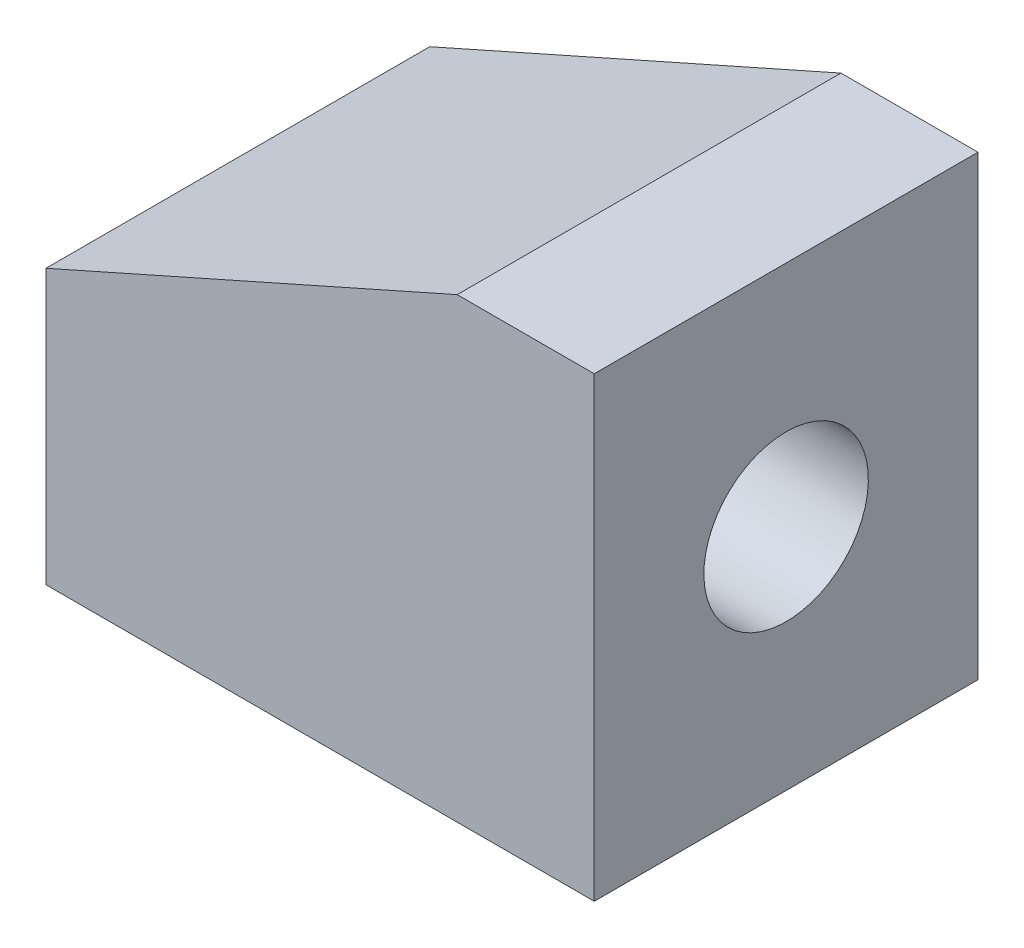
ISO-10303-21;
HEADER;
FILE_DESCRIPTION(('STEP AP214'),'2;1');
FILE_NAME('part.step','',(''),(''),'','','');
FILE_SCHEMA(('AUTOMOTIVE_DESIGN { 1 0 10303 214 1 1 1 1 }'));
ENDSEC;
DATA;
#1=APPLICATION_CONTEXT('core data for automotive mechanical design processes');
#2=APPLICATION_PROTOCOL_DEFINITION('international standard','automotive_design',2000,#1);
#3=PRODUCT_CONTEXT('',#1,'mechanical');
#4=PRODUCT('Part','Part','',(#3));
#5=PRODUCT_RELATED_PRODUCT_CATEGORY('part','',(#4));
#6=PRODUCT_DEFINITION_FORMATION('','',#4);
#7=PRODUCT_DEFINITION_CONTEXT('part definition',#1,'design');
#8=PRODUCT_DEFINITION('design','',#6,#7);
#9=PRODUCT_DEFINITION_SHAPE('','',#8);
#10=(LENGTH_UNIT() NAMED_UNIT(*) SI_UNIT(.MILLI.,.METRE.));
#11=(NAMED_UNIT(*) PLANE_ANGLE_UNIT() SI_UNIT($,.RADIAN.));
#12=(NAMED_UNIT(*) SI_UNIT($,.STERADIAN.) SOLID_ANGLE_UNIT());
#13=UNCERTAINTY_MEASURE_WITH_UNIT(LENGTH_MEASURE(1.E-05),#10,'distance_accuracy_value','');
#14=(GEOMETRIC_REPRESENTATION_CONTEXT(3) GLOBAL_UNCERTAINTY_ASSIGNED_CONTEXT((#13)) GLOBAL_UNIT_ASSIGNED_CONTEXT((#10,
#11,#12)) REPRESENTATION_CONTEXT('',''));
#15=CARTESIAN_POINT('',(0.,0.,0.));
#16=DIRECTION('',(0.,0.,1.));
#17=DIRECTION('',(1.,0.,0.));
#18=AXIS2_PLACEMENT_3D('',#15,#16,#17);
#19=CARTESIAN_POINT('',(0.,50.,21.));
#20=DIRECTION('',(-1.,0.,0.));
#21=DIRECTION('',(0.,-1.,0.));
#22=AXIS2_PLACEMENT_3D('',#19,#20,#21);
#23=PLANE('',#22);
#24=CARTESIAN_POINT('',(0.,25.,0.));
#25=DIRECTION('',(1.,0.,0.));
#26=DIRECTION('',(0.,1.,0.));
#27=AXIS2_PLACEMENT_3D('',#24,#25,#26);
#28=CIRCLE('',#27,9.);
#29=CARTESIAN_POINT('',(0.,34.,0.));
#30=VERTEX_POINT('',#29);
#31=EDGE_CURVE('E162',#30,#30,#28,.T.);
#32=ORIENTED_EDGE('',*,*,#31,.F.);
#33=EDGE_LOOP('',(#32));
#34=FACE_BOUND('',#33,.T.);
#35=DIRECTION('',(0.,1.,0.));
#36=VECTOR('',#35,1.);
#37=CARTESIAN_POINT('',(0.,50.,-21.));
#38=LINE('',#37,#36);
#39=CARTESIAN_POINT('',(0.,0.,-21.));
#40=VERTEX_POINT('',#39);
#41=CARTESIAN_POINT('',(0.,50.,-21.));
#42=VERTEX_POINT('',#41);
#43=EDGE_CURVE('E118',#40,#42,#38,.T.);
#44=ORIENTED_EDGE('',*,*,#43,.T.);
#45=DIRECTION('',(0.,0.,-1.));
#46=VECTOR('',#45,1.);
#47=CARTESIAN_POINT('',(0.,50.,21.));
#48=LINE('',#47,#46);
#49=CARTESIAN_POINT('',(0.,50.,21.));
#50=VERTEX_POINT('',#49);
#51=EDGE_CURVE('E11',#50,#42,#48,.T.);
#52=ORIENTED_EDGE('',*,*,#51,.F.);
#53=DIRECTION('',(0.,1.,0.));
#54=VECTOR('',#53,1.);
#55=CARTESIAN_POINT('',(0.,50.,21.));
#56=LINE('',#55,#54);
#57=CARTESIAN_POINT('',(0.,0.,21.));
#58=VERTEX_POINT('',#57);
#59=EDGE_CURVE('E132',#58,#50,#56,.T.);
#60=ORIENTED_EDGE('',*,*,#59,.F.);
#61=DIRECTION('',(0.,0.,-1.));
#62=VECTOR('',#61,1.);
#63=CARTESIAN_POINT('',(0.,0.,21.));
#64=LINE('',#63,#62);
#65=EDGE_CURVE('E114',#58,#40,#64,.T.);
#66=ORIENTED_EDGE('',*,*,#65,.T.);
#67=EDGE_LOOP('',(#44,#52,#60,#66));
#68=FACE_BOUND('',#67,.T.);
#69=ADVANCED_FACE('F38',(#34,#68),#23,.F.);
#70=CARTESIAN_POINT('',(-15.,50.,21.));
#71=DIRECTION('',(0.,-1.,0.));
#72=DIRECTION('',(0.,0.,-1.));
#73=AXIS2_PLACEMENT_3D('',#70,#71,#72);
#74=PLANE('',#73);
#75=DIRECTION('',(-1.,0.,0.));
#76=VECTOR('',#75,1.);
#77=CARTESIAN_POINT('',(-15.,50.,-21.));
#78=LINE('',#77,#76);
#79=CARTESIAN_POINT('',(-15.,50.,-21.));
#80=VERTEX_POINT('',#79);
#81=EDGE_CURVE('E122',#42,#80,#78,.T.);
#82=ORIENTED_EDGE('',*,*,#81,.T.);
#83=DIRECTION('',(0.,0.,-1.));
#84=VECTOR('',#83,1.);
#85=CARTESIAN_POINT('',(-15.,50.,21.));
#86=LINE('',#85,#84);
#87=CARTESIAN_POINT('',(-15.,50.,21.));
#88=VERTEX_POINT('',#87);
#89=EDGE_CURVE('E47',#88,#80,#86,.T.);
#90=ORIENTED_EDGE('',*,*,#89,.F.);
#91=DIRECTION('',(-1.,0.,0.));
#92=VECTOR('',#91,1.);
#93=CARTESIAN_POINT('',(-15.,50.,21.));
#94=LINE('',#93,#92);
#95=EDGE_CURVE('E89',#50,#88,#94,.T.);
#96=ORIENTED_EDGE('',*,*,#95,.F.);
#97=ORIENTED_EDGE('',*,*,#51,.T.);
#98=EDGE_LOOP('',(#82,#90,#96,#97));
#99=FACE_BOUND('',#98,.T.);
#100=ADVANCED_FACE('F155',(#99),#74,.F.);
#101=CARTESIAN_POINT('',(-60.,30.,21.));
#102=DIRECTION('',(0.406138466053448,-0.913811548620257,0.));
#103=DIRECTION('',(0.913811548620257,0.406138466053448,0.));
#104=AXIS2_PLACEMENT_3D('',#101,#102,#103);
#105=PLANE('',#104);
#106=DIRECTION('',(-0.913811548620257,-0.406138466053448,0.));
#107=VECTOR('',#106,1.);
#108=CARTESIAN_POINT('',(-60.,30.,-21.));
#109=LINE('',#108,#107);
#110=CARTESIAN_POINT('',(-60.,30.,-21.));
#111=VERTEX_POINT('',#110);
#112=EDGE_CURVE('E105',#80,#111,#109,.T.);
#113=ORIENTED_EDGE('',*,*,#112,.T.);
#114=DIRECTION('',(0.,0.,-1.));
#115=VECTOR('',#114,1.);
#116=CARTESIAN_POINT('',(-60.,30.,21.));
#117=LINE('',#116,#115);
#118=CARTESIAN_POINT('',(-60.,30.,21.));
#119=VERTEX_POINT('',#118);
#120=EDGE_CURVE('E102',#119,#111,#117,.T.);
#121=ORIENTED_EDGE('',*,*,#120,.F.);
#122=DIRECTION('',(-0.913811548620257,-0.406138466053448,0.));
#123=VECTOR('',#122,1.);
#124=CARTESIAN_POINT('',(-60.,30.,21.));
#125=LINE('',#124,#123);
#126=EDGE_CURVE('E93',#88,#119,#125,.T.);
#127=ORIENTED_EDGE('',*,*,#126,.F.);
#128=ORIENTED_EDGE('',*,*,#89,.T.);
#129=EDGE_LOOP('',(#113,#121,#127,#128));
#130=FACE_BOUND('',#129,.T.);
#131=ADVANCED_FACE('F103',(#130),#105,.F.);
#132=CARTESIAN_POINT('',(-60.,0.,21.));
#133=DIRECTION('',(1.,0.,0.));
#134=DIRECTION('',(0.,0.,-1.));
#135=AXIS2_PLACEMENT_3D('',#132,#133,#134);
#136=PLANE('',#135);
#137=DIRECTION('',(0.,-1.,0.));
#138=VECTOR('',#137,1.);
#139=CARTESIAN_POINT('',(-60.,0.,-21.));
#140=LINE('',#139,#138);
#141=CARTESIAN_POINT('',(-60.,0.,-21.));
#142=VERTEX_POINT('',#141);
#143=EDGE_CURVE('E75',#111,#142,#140,.T.);
#144=ORIENTED_EDGE('',*,*,#143,.T.);
#145=DIRECTION('',(0.,0.,-1.));
#146=VECTOR('',#145,1.);
#147=CARTESIAN_POINT('',(-60.,0.,21.));
#148=LINE('',#147,#146);
#149=CARTESIAN_POINT('',(-60.,0.,21.));
#150=VERTEX_POINT('',#149);
#151=EDGE_CURVE('E107',#150,#142,#148,.T.);
#152=ORIENTED_EDGE('',*,*,#151,.F.);
#153=DIRECTION('',(0.,-1.,0.));
#154=VECTOR('',#153,1.);
#155=CARTESIAN_POINT('',(-60.,0.,21.));
#156=LINE('',#155,#154);
#157=EDGE_CURVE('E97',#119,#150,#156,.T.);
#158=ORIENTED_EDGE('',*,*,#157,.F.);
#159=ORIENTED_EDGE('',*,*,#120,.T.);
#160=EDGE_LOOP('',(#144,#152,#158,#159));
#161=FACE_BOUND('',#160,.T.);
#162=ADVANCED_FACE('F109',(#161),#136,.F.);
#163=CARTESIAN_POINT('',(0.,0.,21.));
#164=DIRECTION('',(0.,1.,0.));
#165=DIRECTION('',(0.,0.,1.));
#166=AXIS2_PLACEMENT_3D('',#163,#164,#165);
#167=PLANE('',#166);
#168=DIRECTION('',(1.,0.,0.));
#169=VECTOR('',#168,1.);
#170=CARTESIAN_POINT('',(0.,0.,-21.));
#171=LINE('',#170,#169);
#172=EDGE_CURVE('E81',#142,#40,#171,.T.);
#173=ORIENTED_EDGE('',*,*,#172,.T.);
#174=ORIENTED_EDGE('',*,*,#65,.F.);
#175=DIRECTION('',(1.,0.,0.));
#176=VECTOR('',#175,1.);
#177=CARTESIAN_POINT('',(0.,0.,21.));
#178=LINE('',#177,#176);
#179=EDGE_CURVE('E55',#150,#58,#178,.T.);
#180=ORIENTED_EDGE('',*,*,#179,.F.);
#181=ORIENTED_EDGE('',*,*,#151,.T.);
#182=EDGE_LOOP('',(#173,#174,#180,#181));
#183=FACE_BOUND('',#182,.T.);
#184=ADVANCED_FACE('F144',(#183),#167,.F.);
#185=CARTESIAN_POINT('',(0.,0.,21.));
#186=DIRECTION('',(0.,0.,-1.));
#187=DIRECTION('',(-1.,0.,0.));
#188=AXIS2_PLACEMENT_3D('',#185,#186,#187);
#189=PLANE('',#188);
#190=ORIENTED_EDGE('',*,*,#59,.T.);
#191=ORIENTED_EDGE('',*,*,#95,.T.);
#192=ORIENTED_EDGE('',*,*,#126,.T.);
#193=ORIENTED_EDGE('',*,*,#157,.T.);
#194=ORIENTED_EDGE('',*,*,#179,.T.);
#195=EDGE_LOOP('',(#190,#191,#192,#193,#194));
#196=FACE_BOUND('',#195,.T.);
#197=ADVANCED_FACE('F95',(#196),#189,.F.);
#198=CARTESIAN_POINT('',(0.,0.,-21.));
#199=DIRECTION('',(0.,0.,-1.));
#200=DIRECTION('',(-1.,0.,0.));
#201=AXIS2_PLACEMENT_3D('',#198,#199,#200);
#202=PLANE('',#201);
#203=ORIENTED_EDGE('',*,*,#43,.F.);
#204=ORIENTED_EDGE('',*,*,#172,.F.);
#205=ORIENTED_EDGE('',*,*,#143,.F.);
#206=ORIENTED_EDGE('',*,*,#112,.F.);
#207=ORIENTED_EDGE('',*,*,#81,.F.);
#208=EDGE_LOOP('',(#203,#204,#205,#206,#207));
#209=FACE_BOUND('',#208,.T.);
#210=ADVANCED_FACE('F140',(#209),#202,.T.);
#211=CARTESIAN_POINT('',(-40.,25.,0.));
#212=DIRECTION('',(1.,0.,0.));
#213=DIRECTION('',(0.,1.,0.));
#214=AXIS2_PLACEMENT_3D('',#211,#212,#213);
#215=CYLINDRICAL_SURFACE('',#214,9.);
#216=CARTESIAN_POINT('',(-40.,25.,0.));
#217=DIRECTION('',(1.,0.,0.));
#218=DIRECTION('',(0.,1.,0.));
#219=AXIS2_PLACEMENT_3D('',#216,#217,#218);
#220=CIRCLE('',#219,9.);
#221=CARTESIAN_POINT('',(-40.,34.,0.));
#222=VERTEX_POINT('',#221);
#223=EDGE_CURVE('E123',#222,#222,#220,.T.);
#224=ORIENTED_EDGE('',*,*,#223,.F.);
#225=EDGE_LOOP('',(#224));
#226=FACE_BOUND('',#225,.T.);
#227=ORIENTED_EDGE('',*,*,#31,.T.);
#228=EDGE_LOOP('',(#227));
#229=FACE_BOUND('',#228,.T.);
#230=ADVANCED_FACE('F186',(#226,#229),#215,.F.);
#231=CARTESIAN_POINT('',(-40.,25.,0.));
#232=DIRECTION('',(1.,0.,0.));
#233=DIRECTION('',(0.,1.,0.));
#234=AXIS2_PLACEMENT_3D('',#231,#232,#233);
#235=PLANE('',#234);
#236=ORIENTED_EDGE('',*,*,#223,.T.);
#237=EDGE_LOOP('',(#236));
#238=FACE_BOUND('',#237,.T.);
#239=ADVANCED_FACE('F184',(#238),#235,.T.);
#240=CLOSED_SHELL('',(#69,#100,#131,#162,#184,#197,#210,#230,#239));
#241=MANIFOLD_SOLID_BREP('B2',#240);
#242=ADVANCED_BREP_SHAPE_REPRESENTATION('',(#18,#241),#14);
#243=SHAPE_DEFINITION_REPRESENTATION(#9,#242);
ENDSEC;
END-ISO-10303-21;
